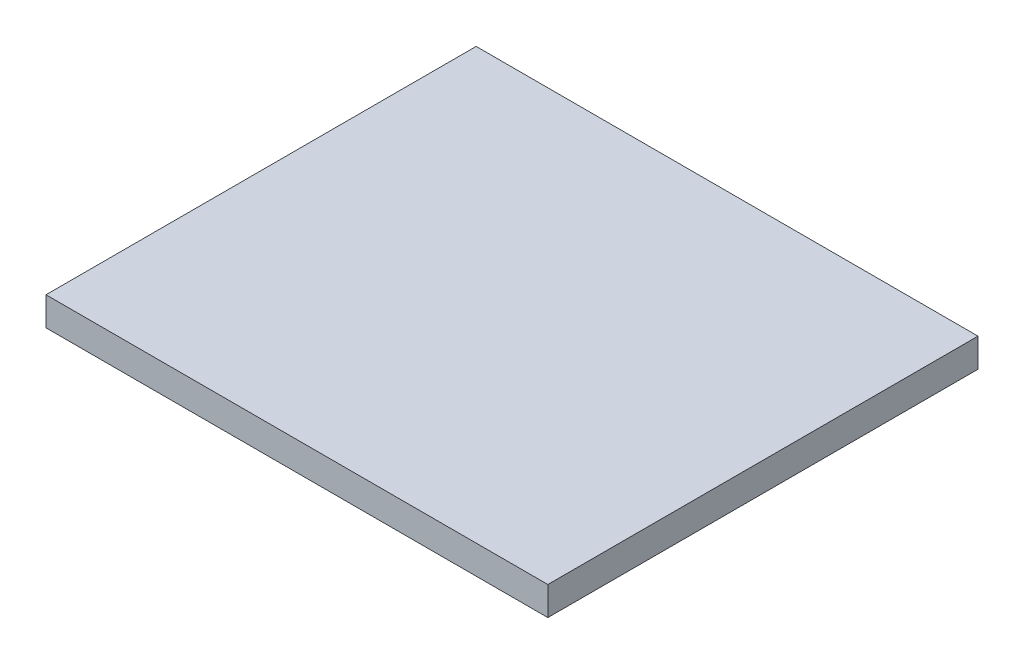
ISO-10303-21;
HEADER;
FILE_DESCRIPTION(('STEP AP214'),'2;1');
FILE_NAME('part.step','',(''),(''),'','','');
FILE_SCHEMA(('AUTOMOTIVE_DESIGN { 1 0 10303 214 1 1 1 1 }'));
ENDSEC;
DATA;
#1=APPLICATION_CONTEXT('core data for automotive mechanical design processes');
#2=APPLICATION_PROTOCOL_DEFINITION('international standard','automotive_design',2000,#1);
#3=PRODUCT_CONTEXT('',#1,'mechanical');
#4=PRODUCT('Part','Part','',(#3));
#5=PRODUCT_RELATED_PRODUCT_CATEGORY('part','',(#4));
#6=PRODUCT_DEFINITION_FORMATION('','',#4);
#7=PRODUCT_DEFINITION_CONTEXT('part definition',#1,'design');
#8=PRODUCT_DEFINITION('design','',#6,#7);
#9=PRODUCT_DEFINITION_SHAPE('','',#8);
#10=(LENGTH_UNIT() NAMED_UNIT(*) SI_UNIT(.MILLI.,.METRE.));
#11=(NAMED_UNIT(*) PLANE_ANGLE_UNIT() SI_UNIT($,.RADIAN.));
#12=(NAMED_UNIT(*) SI_UNIT($,.STERADIAN.) SOLID_ANGLE_UNIT());
#13=UNCERTAINTY_MEASURE_WITH_UNIT(LENGTH_MEASURE(1.E-05),#10,'distance_accuracy_value','');
#14=(GEOMETRIC_REPRESENTATION_CONTEXT(3) GLOBAL_UNCERTAINTY_ASSIGNED_CONTEXT((#13)) GLOBAL_UNIT_ASSIGNED_CONTEXT((#10,
#11,#12)) REPRESENTATION_CONTEXT('',''));
#15=CARTESIAN_POINT('',(0.,0.,0.));
#16=DIRECTION('',(0.,0.,1.));
#17=DIRECTION('',(1.,0.,0.));
#18=AXIS2_PLACEMENT_3D('',#15,#16,#17);
#19=CARTESIAN_POINT('',(0.,10.,0.));
#20=DIRECTION('',(0.,0.,-1.));
#21=DIRECTION('',(-1.,0.,0.));
#22=AXIS2_PLACEMENT_3D('',#19,#20,#21);
#23=PLANE('',#22);
#24=DIRECTION('',(1.,0.,0.));
#25=VECTOR('',#24,1.);
#26=CARTESIAN_POINT('',(0.,0.,0.));
#27=LINE('',#26,#25);
#28=CARTESIAN_POINT('',(0.,0.,0.));
#29=VERTEX_POINT('',#28);
#30=CARTESIAN_POINT('',(175.,0.,0.));
#31=VERTEX_POINT('',#30);
#32=EDGE_CURVE('E107',#29,#31,#27,.T.);
#33=ORIENTED_EDGE('',*,*,#32,.T.);
#34=DIRECTION('',(0.,-1.,0.));
#35=VECTOR('',#34,1.);
#36=CARTESIAN_POINT('',(175.,10.,0.));
#37=LINE('',#36,#35);
#38=CARTESIAN_POINT('',(175.,10.,0.));
#39=VERTEX_POINT('',#38);
#40=EDGE_CURVE('E11',#39,#31,#37,.T.);
#41=ORIENTED_EDGE('',*,*,#40,.F.);
#42=DIRECTION('',(1.,0.,0.));
#43=VECTOR('',#42,1.);
#44=CARTESIAN_POINT('',(0.,10.,0.));
#45=LINE('',#44,#43);
#46=CARTESIAN_POINT('',(0.,10.,0.));
#47=VERTEX_POINT('',#46);
#48=EDGE_CURVE('E89',#47,#39,#45,.T.);
#49=ORIENTED_EDGE('',*,*,#48,.F.);
#50=DIRECTION('',(0.,-1.,0.));
#51=VECTOR('',#50,1.);
#52=CARTESIAN_POINT('',(0.,10.,0.));
#53=LINE('',#52,#51);
#54=EDGE_CURVE('E56',#47,#29,#53,.T.);
#55=ORIENTED_EDGE('',*,*,#54,.T.);
#56=EDGE_LOOP('',(#33,#41,#49,#55));
#57=FACE_BOUND('',#56,.T.);
#58=ADVANCED_FACE('F39',(#57),#23,.F.);
#59=CARTESIAN_POINT('',(175.,10.,0.));
#60=DIRECTION('',(-1.,0.,0.));
#61=DIRECTION('',(0.,0.,1.));
#62=AXIS2_PLACEMENT_3D('',#59,#60,#61);
#63=PLANE('',#62);
#64=DIRECTION('',(0.,0.,-1.));
#65=VECTOR('',#64,1.);
#66=CARTESIAN_POINT('',(175.,0.,0.));
#67=LINE('',#66,#65);
#68=CARTESIAN_POINT('',(175.,0.,-150.));
#69=VERTEX_POINT('',#68);
#70=EDGE_CURVE('E95',#31,#69,#67,.T.);
#71=ORIENTED_EDGE('',*,*,#70,.T.);
#72=DIRECTION('',(0.,-1.,0.));
#73=VECTOR('',#72,1.);
#74=CARTESIAN_POINT('',(175.,10.,-150.));
#75=LINE('',#74,#73);
#76=CARTESIAN_POINT('',(175.,10.,-150.));
#77=VERTEX_POINT('',#76);
#78=EDGE_CURVE('E48',#77,#69,#75,.T.);
#79=ORIENTED_EDGE('',*,*,#78,.F.);
#80=DIRECTION('',(0.,0.,-1.));
#81=VECTOR('',#80,1.);
#82=CARTESIAN_POINT('',(175.,10.,0.));
#83=LINE('',#82,#81);
#84=EDGE_CURVE('E81',#39,#77,#83,.T.);
#85=ORIENTED_EDGE('',*,*,#84,.F.);
#86=ORIENTED_EDGE('',*,*,#40,.T.);
#87=EDGE_LOOP('',(#71,#79,#85,#86));
#88=FACE_BOUND('',#87,.T.);
#89=ADVANCED_FACE('F94',(#88),#63,.F.);
#90=CARTESIAN_POINT('',(0.,10.,-150.));
#91=DIRECTION('',(0.,0.,-1.));
#92=DIRECTION('',(-1.,0.,0.));
#93=AXIS2_PLACEMENT_3D('',#90,#91,#92);
#94=PLANE('',#93);
#95=DIRECTION('',(1.,0.,0.));
#96=VECTOR('',#95,1.);
#97=CARTESIAN_POINT('',(0.,0.,-150.));
#98=LINE('',#97,#96);
#99=CARTESIAN_POINT('',(0.,0.,-150.));
#100=VERTEX_POINT('',#99);
#101=EDGE_CURVE('E112',#100,#69,#98,.T.);
#102=ORIENTED_EDGE('',*,*,#101,.F.);
#103=DIRECTION('',(0.,-1.,0.));
#104=VECTOR('',#103,1.);
#105=CARTESIAN_POINT('',(0.,10.,-150.));
#106=LINE('',#105,#104);
#107=CARTESIAN_POINT('',(0.,10.,-150.));
#108=VERTEX_POINT('',#107);
#109=EDGE_CURVE('E70',#108,#100,#106,.T.);
#110=ORIENTED_EDGE('',*,*,#109,.F.);
#111=DIRECTION('',(1.,0.,0.));
#112=VECTOR('',#111,1.);
#113=CARTESIAN_POINT('',(0.,10.,-150.));
#114=LINE('',#113,#112);
#115=EDGE_CURVE('E88',#108,#77,#114,.T.);
#116=ORIENTED_EDGE('',*,*,#115,.T.);
#117=ORIENTED_EDGE('',*,*,#78,.T.);
#118=EDGE_LOOP('',(#102,#110,#116,#117));
#119=FACE_BOUND('',#118,.T.);
#120=ADVANCED_FACE('F99',(#119),#94,.T.);
#121=CARTESIAN_POINT('',(0.,10.,0.));
#122=DIRECTION('',(-1.,0.,0.));
#123=DIRECTION('',(0.,0.,1.));
#124=AXIS2_PLACEMENT_3D('',#121,#122,#123);
#125=PLANE('',#124);
#126=DIRECTION('',(0.,0.,-1.));
#127=VECTOR('',#126,1.);
#128=CARTESIAN_POINT('',(0.,0.,0.));
#129=LINE('',#128,#127);
#130=EDGE_CURVE('E115',#29,#100,#129,.T.);
#131=ORIENTED_EDGE('',*,*,#130,.F.);
#132=ORIENTED_EDGE('',*,*,#54,.F.);
#133=DIRECTION('',(0.,0.,-1.));
#134=VECTOR('',#133,1.);
#135=CARTESIAN_POINT('',(0.,10.,0.));
#136=LINE('',#135,#134);
#137=EDGE_CURVE('E101',#47,#108,#136,.T.);
#138=ORIENTED_EDGE('',*,*,#137,.T.);
#139=ORIENTED_EDGE('',*,*,#109,.T.);
#140=EDGE_LOOP('',(#131,#132,#138,#139));
#141=FACE_BOUND('',#140,.T.);
#142=ADVANCED_FACE('F125',(#141),#125,.T.);
#143=CARTESIAN_POINT('',(0.,10.,0.));
#144=DIRECTION('',(0.,1.,0.));
#145=DIRECTION('',(0.,0.,1.));
#146=AXIS2_PLACEMENT_3D('',#143,#144,#145);
#147=PLANE('',#146);
#148=ORIENTED_EDGE('',*,*,#48,.T.);
#149=ORIENTED_EDGE('',*,*,#84,.T.);
#150=ORIENTED_EDGE('',*,*,#115,.F.);
#151=ORIENTED_EDGE('',*,*,#137,.F.);
#152=EDGE_LOOP('',(#148,#149,#150,#151));
#153=FACE_BOUND('',#152,.T.);
#154=ADVANCED_FACE('F85',(#153),#147,.T.);
#155=CARTESIAN_POINT('',(0.,0.,0.));
#156=DIRECTION('',(0.,1.,0.));
#157=DIRECTION('',(0.,0.,1.));
#158=AXIS2_PLACEMENT_3D('',#155,#156,#157);
#159=PLANE('',#158);
#160=ORIENTED_EDGE('',*,*,#32,.F.);
#161=ORIENTED_EDGE('',*,*,#130,.T.);
#162=ORIENTED_EDGE('',*,*,#101,.T.);
#163=ORIENTED_EDGE('',*,*,#70,.F.);
#164=EDGE_LOOP('',(#160,#161,#162,#163));
#165=FACE_BOUND('',#164,.T.);
#166=ADVANCED_FACE('F124',(#165),#159,.F.);
#167=CLOSED_SHELL('',(#58,#89,#120,#142,#154,#166));
#168=MANIFOLD_SOLID_BREP('B2',#167);
#169=ADVANCED_BREP_SHAPE_REPRESENTATION('',(#18,#168),#14);
#170=SHAPE_DEFINITION_REPRESENTATION(#9,#169);
ENDSEC;
END-ISO-10303-21;
